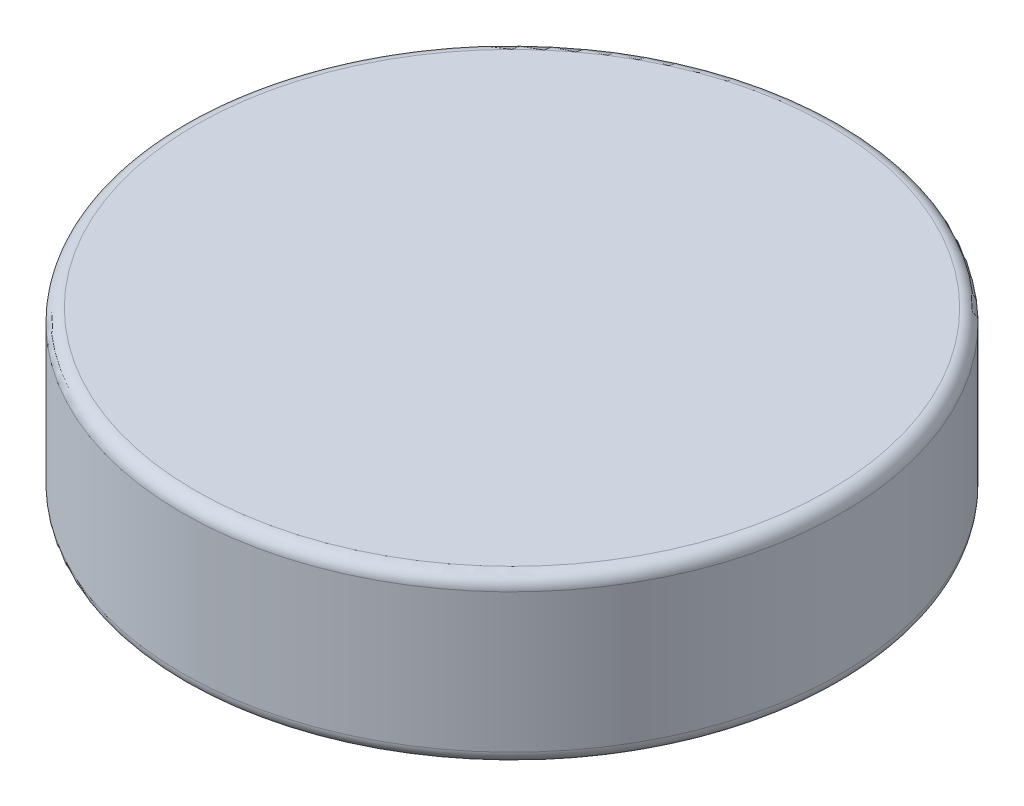
ISO-10303-21;
HEADER;
FILE_DESCRIPTION(('STEP AP214'),'2;1');
FILE_NAME('part.step','',(''),(''),'','','');
FILE_SCHEMA(('AUTOMOTIVE_DESIGN { 1 0 10303 214 1 1 1 1 }'));
ENDSEC;
DATA;
#1=APPLICATION_CONTEXT('core data for automotive mechanical design processes');
#2=APPLICATION_PROTOCOL_DEFINITION('international standard','automotive_design',2000,#1);
#3=PRODUCT_CONTEXT('',#1,'mechanical');
#4=PRODUCT('Part','Part','',(#3));
#5=PRODUCT_RELATED_PRODUCT_CATEGORY('part','',(#4));
#6=PRODUCT_DEFINITION_FORMATION('','',#4);
#7=PRODUCT_DEFINITION_CONTEXT('part definition',#1,'design');
#8=PRODUCT_DEFINITION('design','',#6,#7);
#9=PRODUCT_DEFINITION_SHAPE('','',#8);
#10=(LENGTH_UNIT() NAMED_UNIT(*) SI_UNIT(.MILLI.,.METRE.));
#11=(NAMED_UNIT(*) PLANE_ANGLE_UNIT() SI_UNIT($,.RADIAN.));
#12=(NAMED_UNIT(*) SI_UNIT($,.STERADIAN.) SOLID_ANGLE_UNIT());
#13=UNCERTAINTY_MEASURE_WITH_UNIT(LENGTH_MEASURE(1.E-05),#10,'distance_accuracy_value','');
#14=(GEOMETRIC_REPRESENTATION_CONTEXT(3) GLOBAL_UNCERTAINTY_ASSIGNED_CONTEXT((#13)) GLOBAL_UNIT_ASSIGNED_CONTEXT((#10,
#11,#12)) REPRESENTATION_CONTEXT('',''));
#15=CARTESIAN_POINT('',(0.,0.,0.));
#16=DIRECTION('',(0.,0.,1.));
#17=DIRECTION('',(1.,0.,0.));
#18=AXIS2_PLACEMENT_3D('',#15,#16,#17);
#19=CARTESIAN_POINT('',(0.,3.175,0.));
#20=DIRECTION('',(0.,-1.,0.));
#21=DIRECTION('',(0.,0.,-1.));
#22=AXIS2_PLACEMENT_3D('',#19,#20,#21);
#23=CYLINDRICAL_SURFACE('',#22,12.7);
#24=CARTESIAN_POINT('',(0.,-2.675,0.));
#25=DIRECTION('',(0.,1.,0.));
#26=DIRECTION('',(0.,0.,1.));
#27=AXIS2_PLACEMENT_3D('',#24,#25,#26);
#28=CIRCLE('',#27,12.7);
#29=CARTESIAN_POINT('',(0.,-2.675,12.7));
#30=VERTEX_POINT('',#29);
#31=EDGE_CURVE('E54',#30,#30,#28,.T.);
#32=ORIENTED_EDGE('',*,*,#31,.T.);
#33=EDGE_LOOP('',(#32));
#34=FACE_BOUND('',#33,.T.);
#35=CARTESIAN_POINT('',(0.,2.675,0.));
#36=DIRECTION('',(0.,1.,0.));
#37=DIRECTION('',(0.,0.,1.));
#38=AXIS2_PLACEMENT_3D('',#35,#36,#37);
#39=CIRCLE('',#38,12.7);
#40=CARTESIAN_POINT('',(0.,2.675,12.7));
#41=VERTEX_POINT('',#40);
#42=EDGE_CURVE('E59',#41,#41,#39,.F.);
#43=ORIENTED_EDGE('',*,*,#42,.T.);
#44=EDGE_LOOP('',(#43));
#45=FACE_BOUND('',#44,.T.);
#46=ADVANCED_FACE('F41',(#34,#45),#23,.T.);
#47=CARTESIAN_POINT('',(0.,3.175,0.));
#48=DIRECTION('',(0.,1.,0.));
#49=DIRECTION('',(0.,0.,1.));
#50=AXIS2_PLACEMENT_3D('',#47,#48,#49);
#51=PLANE('',#50);
#52=CARTESIAN_POINT('',(0.,3.175,0.));
#53=DIRECTION('',(0.,1.,0.));
#54=DIRECTION('',(0.,0.,1.));
#55=AXIS2_PLACEMENT_3D('',#52,#53,#54);
#56=CIRCLE('',#55,12.2);
#57=CARTESIAN_POINT('',(0.,3.175,12.2));
#58=VERTEX_POINT('',#57);
#59=EDGE_CURVE('E10',#58,#58,#56,.T.);
#60=ORIENTED_EDGE('',*,*,#59,.T.);
#61=EDGE_LOOP('',(#60));
#62=FACE_BOUND('',#61,.T.);
#63=ADVANCED_FACE('F76',(#62),#51,.T.);
#64=CARTESIAN_POINT('',(0.,-3.175,0.));
#65=DIRECTION('',(0.,1.,0.));
#66=DIRECTION('',(0.,0.,1.));
#67=AXIS2_PLACEMENT_3D('',#64,#65,#66);
#68=PLANE('',#67);
#69=CARTESIAN_POINT('',(0.,-3.175,0.));
#70=DIRECTION('',(0.,1.,0.));
#71=DIRECTION('',(0.,0.,1.));
#72=AXIS2_PLACEMENT_3D('',#69,#70,#71);
#73=CIRCLE('',#72,12.2);
#74=CARTESIAN_POINT('',(0.,-3.175,12.2));
#75=VERTEX_POINT('',#74);
#76=EDGE_CURVE('E49',#75,#75,#73,.F.);
#77=ORIENTED_EDGE('',*,*,#76,.T.);
#78=EDGE_LOOP('',(#77));
#79=FACE_BOUND('',#78,.T.);
#80=ADVANCED_FACE('F73',(#79),#68,.F.);
#81=CARTESIAN_POINT('',(0.,-2.675,0.));
#82=DIRECTION('',(0.,1.,0.));
#83=DIRECTION('',(0.,0.,1.));
#84=AXIS2_PLACEMENT_3D('',#81,#82,#83);
#85=TOROIDAL_SURFACE('',#84,12.2,0.5);
#86=ORIENTED_EDGE('',*,*,#76,.F.);
#87=EDGE_LOOP('',(#86));
#88=FACE_BOUND('',#87,.T.);
#89=ORIENTED_EDGE('',*,*,#31,.F.);
#90=EDGE_LOOP('',(#89));
#91=FACE_BOUND('',#90,.T.);
#92=ADVANCED_FACE('F69',(#88,#91),#85,.T.);
#93=CARTESIAN_POINT('',(0.,2.675,0.));
#94=DIRECTION('',(0.,1.,0.));
#95=DIRECTION('',(0.,0.,1.));
#96=AXIS2_PLACEMENT_3D('',#93,#94,#95);
#97=TOROIDAL_SURFACE('',#96,12.2,0.5);
#98=ORIENTED_EDGE('',*,*,#42,.F.);
#99=EDGE_LOOP('',(#98));
#100=FACE_BOUND('',#99,.T.);
#101=ORIENTED_EDGE('',*,*,#59,.F.);
#102=EDGE_LOOP('',(#101));
#103=FACE_BOUND('',#102,.T.);
#104=ADVANCED_FACE('F43',(#100,#103),#97,.T.);
#105=CLOSED_SHELL('',(#46,#63,#80,#92,#104));
#106=MANIFOLD_SOLID_BREP('B2',#105);
#107=ADVANCED_BREP_SHAPE_REPRESENTATION('',(#18,#106),#14);
#108=SHAPE_DEFINITION_REPRESENTATION(#9,#107);
ENDSEC;
END-ISO-10303-21;
